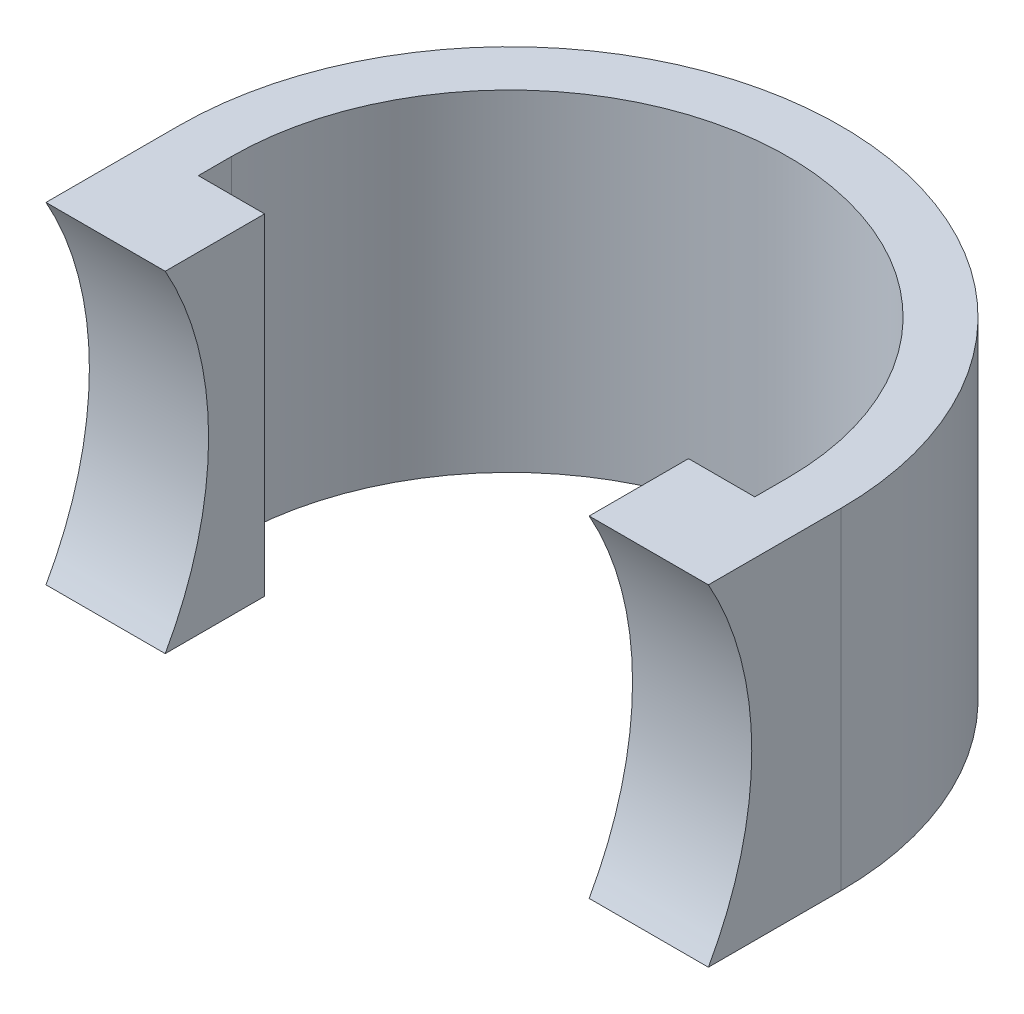
ISO-10303-21;
HEADER;
FILE_DESCRIPTION(('STEP AP214'),'2;1');
FILE_NAME('part.step','',(''),(''),'','','');
FILE_SCHEMA(('AUTOMOTIVE_DESIGN { 1 0 10303 214 1 1 1 1 }'));
ENDSEC;
DATA;
#1=APPLICATION_CONTEXT('core data for automotive mechanical design processes');
#2=APPLICATION_PROTOCOL_DEFINITION('international standard','automotive_design',2000,#1);
#3=PRODUCT_CONTEXT('',#1,'mechanical');
#4=PRODUCT('Part','Part','',(#3));
#5=PRODUCT_RELATED_PRODUCT_CATEGORY('part','',(#4));
#6=PRODUCT_DEFINITION_FORMATION('','',#4);
#7=PRODUCT_DEFINITION_CONTEXT('part definition',#1,'design');
#8=PRODUCT_DEFINITION('design','',#6,#7);
#9=PRODUCT_DEFINITION_SHAPE('','',#8);
#10=(LENGTH_UNIT() NAMED_UNIT(*) SI_UNIT(.MILLI.,.METRE.));
#11=(NAMED_UNIT(*) PLANE_ANGLE_UNIT() SI_UNIT($,.RADIAN.));
#12=(NAMED_UNIT(*) SI_UNIT($,.STERADIAN.) SOLID_ANGLE_UNIT());
#13=UNCERTAINTY_MEASURE_WITH_UNIT(LENGTH_MEASURE(1.E-05),#10,'distance_accuracy_value','');
#14=(GEOMETRIC_REPRESENTATION_CONTEXT(3) GLOBAL_UNCERTAINTY_ASSIGNED_CONTEXT((#13)) GLOBAL_UNIT_ASSIGNED_CONTEXT((#10,
#11,#12)) REPRESENTATION_CONTEXT('',''));
#15=CARTESIAN_POINT('',(0.,0.,0.));
#16=DIRECTION('',(0.,0.,1.));
#17=DIRECTION('',(1.,0.,0.));
#18=AXIS2_PLACEMENT_3D('',#15,#16,#17);
#19=CARTESIAN_POINT('',(-35.0730688935282,14.8225469728601,100.));
#20=DIRECTION('',(1.,0.,0.));
#21=DIRECTION('',(0.,1.,0.));
#22=AXIS2_PLACEMENT_3D('',#19,#20,#21);
#23=PLANE('',#22);
#24=DIRECTION('',(0.,-1.,0.));
#25=VECTOR('',#24,1.);
#26=CARTESIAN_POINT('',(-35.0730688935282,64.8225469728601,80.));
#27=LINE('',#26,#25);
#28=CARTESIAN_POINT('',(-35.0730688935282,14.8225469728601,80.));
#29=VERTEX_POINT('',#28);
#30=CARTESIAN_POINT('',(-35.0730688935282,-35.1774530271399,80.));
#31=VERTEX_POINT('',#30);
#32=EDGE_CURVE('E55',#29,#31,#27,.T.);
#33=ORIENTED_EDGE('',*,*,#32,.T.);
#34=DIRECTION('',(0.,0.,-1.));
#35=VECTOR('',#34,1.);
#36=CARTESIAN_POINT('',(-35.0730688935282,-35.1774530271399,100.));
#37=LINE('',#36,#35);
#38=CARTESIAN_POINT('',(-35.0730688935282,-35.1774530271399,100.));
#39=VERTEX_POINT('',#38);
#40=EDGE_CURVE('E140',#39,#31,#37,.T.);
#41=ORIENTED_EDGE('',*,*,#40,.F.);
#42=CARTESIAN_POINT('',(-35.0730688935282,-10.1774530271399,144.452221541786));
#43=DIRECTION('',(-1.,0.,0.));
#44=DIRECTION('',(0.,-1.,0.));
#45=AXIS2_PLACEMENT_3D('',#42,#43,#44);
#46=CIRCLE('',#45,51.);
#47=CARTESIAN_POINT('',(-35.0730688935282,14.82254697286,100.));
#48=VERTEX_POINT('',#47);
#49=EDGE_CURVE('E209',#48,#39,#46,.T.);
#50=ORIENTED_EDGE('',*,*,#49,.F.);
#51=DIRECTION('',(0.,0.,-1.));
#52=VECTOR('',#51,1.);
#53=CARTESIAN_POINT('',(-35.0730688935282,14.8225469728601,100.));
#54=LINE('',#53,#52);
#55=EDGE_CURVE('E142',#48,#29,#54,.T.);
#56=ORIENTED_EDGE('',*,*,#55,.T.);
#57=EDGE_LOOP('',(#33,#41,#50,#56));
#58=FACE_BOUND('',#57,.T.);
#59=ADVANCED_FACE('F41',(#58),#23,.F.);
#60=CARTESIAN_POINT('',(64.9269311064718,-10.1774530271399,144.452221541786));
#61=DIRECTION('',(-1.,0.,0.));
#62=DIRECTION('',(0.,-1.,0.));
#63=AXIS2_PLACEMENT_3D('',#60,#61,#62);
#64=CYLINDRICAL_SURFACE('',#63,51.);
#65=DIRECTION('',(1.,0.,0.));
#66=VECTOR('',#65,1.);
#67=CARTESIAN_POINT('',(-35.0730688935282,-35.1774530271399,100.));
#68=LINE('',#67,#66);
#69=CARTESIAN_POINT('',(-17.0730688935282,-35.1774530271399,100.));
#70=VERTEX_POINT('',#69);
#71=EDGE_CURVE('E148',#39,#70,#68,.T.);
#72=ORIENTED_EDGE('',*,*,#71,.T.);
#73=CARTESIAN_POINT('',(-17.0730688935282,-10.1774530271399,144.452221541786));
#74=DIRECTION('',(-1.,0.,0.));
#75=DIRECTION('',(0.,0.,1.));
#76=AXIS2_PLACEMENT_3D('',#73,#74,#75);
#77=CIRCLE('',#76,51.);
#78=CARTESIAN_POINT('',(-17.0730688935282,14.82254697286,100.));
#79=VERTEX_POINT('',#78);
#80=EDGE_CURVE('E152',#70,#79,#77,.F.);
#81=ORIENTED_EDGE('',*,*,#80,.T.);
#82=DIRECTION('',(-1.,0.,0.));
#83=VECTOR('',#82,1.);
#84=CARTESIAN_POINT('',(-35.0730688935282,14.8225469728601,100.));
#85=LINE('',#84,#83);
#86=EDGE_CURVE('E216',#79,#48,#85,.T.);
#87=ORIENTED_EDGE('',*,*,#86,.T.);
#88=ORIENTED_EDGE('',*,*,#49,.T.);
#89=EDGE_LOOP('',(#72,#81,#87,#88));
#90=FACE_BOUND('',#89,.T.);
#91=ADVANCED_FACE('F254',(#90),#64,.F.);
#92=CARTESIAN_POINT('',(-35.0730688935282,-35.1774530271399,100.));
#93=DIRECTION('',(0.,1.,0.));
#94=DIRECTION('',(0.,0.,1.));
#95=AXIS2_PLACEMENT_3D('',#92,#93,#94);
#96=PLANE('',#95);
#97=ORIENTED_EDGE('',*,*,#40,.T.);
#98=CARTESIAN_POINT('',(14.9269311064718,-35.1774530271399,80.));
#99=DIRECTION('',(0.,1.,0.));
#100=DIRECTION('',(0.,0.,-1.));
#101=AXIS2_PLACEMENT_3D('',#98,#99,#100);
#102=CIRCLE('',#101,50.);
#103=CARTESIAN_POINT('',(64.9269311064718,-35.1774530271399,80.));
#104=VERTEX_POINT('',#103);
#105=EDGE_CURVE('E126',#104,#31,#102,.T.);
#106=ORIENTED_EDGE('',*,*,#105,.F.);
#107=DIRECTION('',(0.,0.,-1.));
#108=VECTOR('',#107,1.);
#109=CARTESIAN_POINT('',(64.9269311064718,-35.1774530271399,100.));
#110=LINE('',#109,#108);
#111=CARTESIAN_POINT('',(64.9269311064718,-35.1774530271398,100.));
#112=VERTEX_POINT('',#111);
#113=EDGE_CURVE('E150',#112,#104,#110,.T.);
#114=ORIENTED_EDGE('',*,*,#113,.F.);
#115=CARTESIAN_POINT('',(46.9269311064718,-35.1774530271399,100.));
#116=VERTEX_POINT('',#115);
#117=EDGE_CURVE('E213',#116,#112,#68,.T.);
#118=ORIENTED_EDGE('',*,*,#117,.F.);
#119=DIRECTION('',(0.,0.,1.));
#120=VECTOR('',#119,1.);
#121=CARTESIAN_POINT('',(46.9269311064718,-35.1774530271399,100.));
#122=LINE('',#121,#120);
#123=CARTESIAN_POINT('',(46.9269311064718,-35.1774530271399,85.));
#124=VERTEX_POINT('',#123);
#125=EDGE_CURVE('E62',#124,#116,#122,.T.);
#126=ORIENTED_EDGE('',*,*,#125,.F.);
#127=DIRECTION('',(-1.,0.,0.));
#128=VECTOR('',#127,1.);
#129=CARTESIAN_POINT('',(46.9269311064718,-35.1774530271399,85.));
#130=LINE('',#129,#128);
#131=CARTESIAN_POINT('',(56.9269311064718,-35.1774530271399,85.));
#132=VERTEX_POINT('',#131);
#133=EDGE_CURVE('E236',#132,#124,#130,.T.);
#134=ORIENTED_EDGE('',*,*,#133,.F.);
#135=DIRECTION('',(0.,0.,1.));
#136=VECTOR('',#135,1.);
#137=CARTESIAN_POINT('',(56.9269311064718,-35.1774530271399,80.));
#138=LINE('',#137,#136);
#139=CARTESIAN_POINT('',(56.9269311064718,-35.1774530271399,80.));
#140=VERTEX_POINT('',#139);
#141=EDGE_CURVE('E191',#140,#132,#138,.T.);
#142=ORIENTED_EDGE('',*,*,#141,.F.);
#143=CARTESIAN_POINT('',(14.9269311064718,-35.1774530271399,80.));
#144=DIRECTION('',(0.,-1.,0.));
#145=DIRECTION('',(0.,0.,-1.));
#146=AXIS2_PLACEMENT_3D('',#143,#144,#145);
#147=CIRCLE('',#146,42.);
#148=CARTESIAN_POINT('',(-27.0730688935282,-35.1774530271399,80.));
#149=VERTEX_POINT('',#148);
#150=EDGE_CURVE('E232',#149,#140,#147,.T.);
#151=ORIENTED_EDGE('',*,*,#150,.F.);
#152=DIRECTION('',(0.,0.,-1.));
#153=VECTOR('',#152,1.);
#154=CARTESIAN_POINT('',(-27.0730688935282,-35.1774530271399,80.));
#155=LINE('',#154,#153);
#156=CARTESIAN_POINT('',(-27.0730688935282,-35.1774530271399,85.));
#157=VERTEX_POINT('',#156);
#158=EDGE_CURVE('E229',#157,#149,#155,.T.);
#159=ORIENTED_EDGE('',*,*,#158,.F.);
#160=DIRECTION('',(-1.,0.,0.));
#161=VECTOR('',#160,1.);
#162=CARTESIAN_POINT('',(-27.0730688935282,-35.1774530271399,85.));
#163=LINE('',#162,#161);
#164=CARTESIAN_POINT('',(-17.0730688935282,-35.1774530271399,85.));
#165=VERTEX_POINT('',#164);
#166=EDGE_CURVE('E226',#165,#157,#163,.T.);
#167=ORIENTED_EDGE('',*,*,#166,.F.);
#168=DIRECTION('',(0.,0.,-1.));
#169=VECTOR('',#168,1.);
#170=CARTESIAN_POINT('',(-17.0730688935282,-35.1774530271399,85.));
#171=LINE('',#170,#169);
#172=EDGE_CURVE('E134',#70,#165,#171,.T.);
#173=ORIENTED_EDGE('',*,*,#172,.F.);
#174=ORIENTED_EDGE('',*,*,#71,.F.);
#175=EDGE_LOOP('',(#97,#106,#114,#118,#126,#134,#142,#151,#159,#167,#173,#174));
#176=FACE_BOUND('',#175,.T.);
#177=ADVANCED_FACE('F145',(#176),#96,.F.);
#178=CARTESIAN_POINT('',(64.9269311064718,14.8225469728601,100.));
#179=DIRECTION('',(-1.,0.,0.));
#180=DIRECTION('',(0.,-1.,0.));
#181=AXIS2_PLACEMENT_3D('',#178,#179,#180);
#182=PLANE('',#181);
#183=ORIENTED_EDGE('',*,*,#113,.T.);
#184=DIRECTION('',(0.,-1.,0.));
#185=VECTOR('',#184,1.);
#186=CARTESIAN_POINT('',(64.9269311064718,64.8225469728601,80.));
#187=LINE('',#186,#185);
#188=CARTESIAN_POINT('',(64.9269311064718,14.8225469728601,80.));
#189=VERTEX_POINT('',#188);
#190=EDGE_CURVE('E129',#189,#104,#187,.T.);
#191=ORIENTED_EDGE('',*,*,#190,.F.);
#192=DIRECTION('',(0.,0.,-1.));
#193=VECTOR('',#192,1.);
#194=CARTESIAN_POINT('',(64.9269311064718,14.8225469728601,100.));
#195=LINE('',#194,#193);
#196=CARTESIAN_POINT('',(64.9269311064718,14.82254697286,100.));
#197=VERTEX_POINT('',#196);
#198=EDGE_CURVE('E154',#197,#189,#195,.T.);
#199=ORIENTED_EDGE('',*,*,#198,.F.);
#200=CARTESIAN_POINT('',(64.9269311064718,-10.1774530271399,144.452221541786));
#201=DIRECTION('',(-1.,0.,0.));
#202=DIRECTION('',(0.,-1.,0.));
#203=AXIS2_PLACEMENT_3D('',#200,#201,#202);
#204=CIRCLE('',#203,51.);
#205=EDGE_CURVE('E210',#197,#112,#204,.T.);
#206=ORIENTED_EDGE('',*,*,#205,.T.);
#207=EDGE_LOOP('',(#183,#191,#199,#206));
#208=FACE_BOUND('',#207,.T.);
#209=ADVANCED_FACE('F221',(#208),#182,.F.);
#210=CARTESIAN_POINT('',(-35.0730688935282,14.8225469728601,100.));
#211=DIRECTION('',(0.,-1.,0.));
#212=DIRECTION('',(0.,0.,-1.));
#213=AXIS2_PLACEMENT_3D('',#210,#211,#212);
#214=PLANE('',#213);
#215=ORIENTED_EDGE('',*,*,#198,.T.);
#216=CARTESIAN_POINT('',(14.9269311064718,14.8225469728601,80.));
#217=DIRECTION('',(0.,-1.,0.));
#218=DIRECTION('',(0.,0.,-1.));
#219=AXIS2_PLACEMENT_3D('',#216,#217,#218);
#220=CIRCLE('',#219,50.);
#221=EDGE_CURVE('E11',#189,#29,#220,.F.);
#222=ORIENTED_EDGE('',*,*,#221,.T.);
#223=ORIENTED_EDGE('',*,*,#55,.F.);
#224=ORIENTED_EDGE('',*,*,#86,.F.);
#225=DIRECTION('',(0.,0.,-1.));
#226=VECTOR('',#225,1.);
#227=CARTESIAN_POINT('',(-17.0730688935282,14.8225469728601,100.));
#228=LINE('',#227,#226);
#229=CARTESIAN_POINT('',(-17.0730688935282,14.8225469728601,85.));
#230=VERTEX_POINT('',#229);
#231=EDGE_CURVE('E206',#79,#230,#228,.T.);
#232=ORIENTED_EDGE('',*,*,#231,.T.);
#233=DIRECTION('',(-1.,0.,0.));
#234=VECTOR('',#233,1.);
#235=CARTESIAN_POINT('',(-35.0730688935282,14.8225469728601,85.));
#236=LINE('',#235,#234);
#237=CARTESIAN_POINT('',(-27.0730688935282,14.8225469728601,85.));
#238=VERTEX_POINT('',#237);
#239=EDGE_CURVE('E160',#230,#238,#236,.T.);
#240=ORIENTED_EDGE('',*,*,#239,.T.);
#241=DIRECTION('',(0.,0.,-1.));
#242=VECTOR('',#241,1.);
#243=CARTESIAN_POINT('',(-27.0730688935282,14.8225469728601,100.));
#244=LINE('',#243,#242);
#245=CARTESIAN_POINT('',(-27.0730688935282,14.8225469728601,80.));
#246=VERTEX_POINT('',#245);
#247=EDGE_CURVE('E163',#238,#246,#244,.T.);
#248=ORIENTED_EDGE('',*,*,#247,.T.);
#249=CARTESIAN_POINT('',(14.9269311064718,14.8225469728601,80.));
#250=DIRECTION('',(0.,-1.,0.));
#251=DIRECTION('',(0.,0.,-1.));
#252=AXIS2_PLACEMENT_3D('',#249,#250,#251);
#253=CIRCLE('',#252,42.);
#254=CARTESIAN_POINT('',(56.9269311064718,14.8225469728601,80.));
#255=VERTEX_POINT('',#254);
#256=EDGE_CURVE('E166',#246,#255,#253,.T.);
#257=ORIENTED_EDGE('',*,*,#256,.T.);
#258=DIRECTION('',(0.,0.,1.));
#259=VECTOR('',#258,1.);
#260=CARTESIAN_POINT('',(56.9269311064718,14.8225469728601,100.));
#261=LINE('',#260,#259);
#262=CARTESIAN_POINT('',(56.9269311064718,14.8225469728601,85.));
#263=VERTEX_POINT('',#262);
#264=EDGE_CURVE('E169',#255,#263,#261,.T.);
#265=ORIENTED_EDGE('',*,*,#264,.T.);
#266=DIRECTION('',(-1.,0.,0.));
#267=VECTOR('',#266,1.);
#268=CARTESIAN_POINT('',(-35.0730688935282,14.8225469728601,85.0000000000001));
#269=LINE('',#268,#267);
#270=CARTESIAN_POINT('',(46.9269311064718,14.8225469728601,85.));
#271=VERTEX_POINT('',#270);
#272=EDGE_CURVE('E48',#263,#271,#269,.T.);
#273=ORIENTED_EDGE('',*,*,#272,.T.);
#274=DIRECTION('',(0.,0.,1.));
#275=VECTOR('',#274,1.);
#276=CARTESIAN_POINT('',(46.9269311064718,14.8225469728601,100.));
#277=LINE('',#276,#275);
#278=CARTESIAN_POINT('',(46.9269311064718,14.82254697286,100.));
#279=VERTEX_POINT('',#278);
#280=EDGE_CURVE('E177',#271,#279,#277,.T.);
#281=ORIENTED_EDGE('',*,*,#280,.T.);
#282=EDGE_CURVE('E217',#197,#279,#85,.T.);
#283=ORIENTED_EDGE('',*,*,#282,.F.);
#284=EDGE_LOOP('',(#215,#222,#223,#224,#232,#240,#248,#257,#265,#273,#281,#283));
#285=FACE_BOUND('',#284,.T.);
#286=ADVANCED_FACE('F175',(#285),#214,.F.);
#287=ORIENTED_EDGE('',*,*,#282,.T.);
#288=CARTESIAN_POINT('',(46.9269311064718,-10.1774530271399,144.452221541786));
#289=DIRECTION('',(1.,0.,0.));
#290=DIRECTION('',(0.,0.,-1.));
#291=AXIS2_PLACEMENT_3D('',#288,#289,#290);
#292=CIRCLE('',#291,51.);
#293=EDGE_CURVE('E149',#279,#116,#292,.F.);
#294=ORIENTED_EDGE('',*,*,#293,.T.);
#295=ORIENTED_EDGE('',*,*,#117,.T.);
#296=ORIENTED_EDGE('',*,*,#205,.F.);
#297=EDGE_LOOP('',(#287,#294,#295,#296));
#298=FACE_BOUND('',#297,.T.);
#299=ADVANCED_FACE('F239',(#298),#64,.F.);
#300=CARTESIAN_POINT('',(46.9269311064718,64.8225469728601,85.));
#301=DIRECTION('',(0.,0.,1.));
#302=DIRECTION('',(1.,0.,0.));
#303=AXIS2_PLACEMENT_3D('',#300,#301,#302);
#304=PLANE('',#303);
#305=DIRECTION('',(0.,-1.,0.));
#306=VECTOR('',#305,1.);
#307=CARTESIAN_POINT('',(56.9269311064718,64.8225469728601,85.));
#308=LINE('',#307,#306);
#309=EDGE_CURVE('E184',#263,#132,#308,.T.);
#310=ORIENTED_EDGE('',*,*,#309,.T.);
#311=ORIENTED_EDGE('',*,*,#133,.T.);
#312=DIRECTION('',(0.,-1.,0.));
#313=VECTOR('',#312,1.);
#314=CARTESIAN_POINT('',(46.9269311064718,64.8225469728601,85.));
#315=LINE('',#314,#313);
#316=EDGE_CURVE('E186',#271,#124,#315,.T.);
#317=ORIENTED_EDGE('',*,*,#316,.F.);
#318=ORIENTED_EDGE('',*,*,#272,.F.);
#319=EDGE_LOOP('',(#310,#311,#317,#318));
#320=FACE_BOUND('',#319,.T.);
#321=ADVANCED_FACE('F182',(#320),#304,.F.);
#322=CARTESIAN_POINT('',(56.9269311064718,64.8225469728601,80.));
#323=DIRECTION('',(1.,0.,0.));
#324=DIRECTION('',(0.,0.,-1.));
#325=AXIS2_PLACEMENT_3D('',#322,#323,#324);
#326=PLANE('',#325);
#327=DIRECTION('',(0.,-1.,0.));
#328=VECTOR('',#327,1.);
#329=CARTESIAN_POINT('',(56.9269311064718,64.8225469728601,80.));
#330=LINE('',#329,#328);
#331=EDGE_CURVE('E193',#255,#140,#330,.T.);
#332=ORIENTED_EDGE('',*,*,#331,.T.);
#333=ORIENTED_EDGE('',*,*,#141,.T.);
#334=ORIENTED_EDGE('',*,*,#309,.F.);
#335=ORIENTED_EDGE('',*,*,#264,.F.);
#336=EDGE_LOOP('',(#332,#333,#334,#335));
#337=FACE_BOUND('',#336,.T.);
#338=ADVANCED_FACE('F188',(#337),#326,.F.);
#339=CARTESIAN_POINT('',(14.9269311064718,64.8225469728601,80.));
#340=DIRECTION('',(0.,-1.,0.));
#341=DIRECTION('',(0.,0.,-1.));
#342=AXIS2_PLACEMENT_3D('',#339,#340,#341);
#343=CYLINDRICAL_SURFACE('',#342,42.);
#344=DIRECTION('',(0.,-1.,0.));
#345=VECTOR('',#344,1.);
#346=CARTESIAN_POINT('',(-27.0730688935282,64.8225469728601,80.));
#347=LINE('',#346,#345);
#348=EDGE_CURVE('E196',#246,#149,#347,.T.);
#349=ORIENTED_EDGE('',*,*,#348,.T.);
#350=ORIENTED_EDGE('',*,*,#150,.T.);
#351=ORIENTED_EDGE('',*,*,#331,.F.);
#352=ORIENTED_EDGE('',*,*,#256,.F.);
#353=EDGE_LOOP('',(#349,#350,#351,#352));
#354=FACE_BOUND('',#353,.T.);
#355=ADVANCED_FACE('F306',(#354),#343,.F.);
#356=CARTESIAN_POINT('',(-27.0730688935282,64.8225469728601,80.));
#357=DIRECTION('',(-1.,0.,0.));
#358=DIRECTION('',(0.,0.,1.));
#359=AXIS2_PLACEMENT_3D('',#356,#357,#358);
#360=PLANE('',#359);
#361=DIRECTION('',(0.,-1.,0.));
#362=VECTOR('',#361,1.);
#363=CARTESIAN_POINT('',(-27.0730688935282,64.8225469728601,85.));
#364=LINE('',#363,#362);
#365=EDGE_CURVE('E201',#238,#157,#364,.T.);
#366=ORIENTED_EDGE('',*,*,#365,.T.);
#367=ORIENTED_EDGE('',*,*,#158,.T.);
#368=ORIENTED_EDGE('',*,*,#348,.F.);
#369=ORIENTED_EDGE('',*,*,#247,.F.);
#370=EDGE_LOOP('',(#366,#367,#368,#369));
#371=FACE_BOUND('',#370,.T.);
#372=ADVANCED_FACE('F315',(#371),#360,.F.);
#373=CARTESIAN_POINT('',(-27.0730688935282,64.8225469728601,85.));
#374=DIRECTION('',(0.,0.,1.));
#375=DIRECTION('',(1.,0.,0.));
#376=AXIS2_PLACEMENT_3D('',#373,#374,#375);
#377=PLANE('',#376);
#378=DIRECTION('',(0.,-1.,0.));
#379=VECTOR('',#378,1.);
#380=CARTESIAN_POINT('',(-17.0730688935282,64.8225469728601,85.));
#381=LINE('',#380,#379);
#382=EDGE_CURVE('E203',#230,#165,#381,.T.);
#383=ORIENTED_EDGE('',*,*,#382,.T.);
#384=ORIENTED_EDGE('',*,*,#166,.T.);
#385=ORIENTED_EDGE('',*,*,#365,.F.);
#386=ORIENTED_EDGE('',*,*,#239,.F.);
#387=EDGE_LOOP('',(#383,#384,#385,#386));
#388=FACE_BOUND('',#387,.T.);
#389=ADVANCED_FACE('F249',(#388),#377,.F.);
#390=CARTESIAN_POINT('',(-17.0730688935282,64.8225469728601,85.));
#391=DIRECTION('',(-1.,0.,0.));
#392=DIRECTION('',(0.,0.,1.));
#393=AXIS2_PLACEMENT_3D('',#390,#391,#392);
#394=PLANE('',#393);
#395=ORIENTED_EDGE('',*,*,#80,.F.);
#396=ORIENTED_EDGE('',*,*,#172,.T.);
#397=ORIENTED_EDGE('',*,*,#382,.F.);
#398=ORIENTED_EDGE('',*,*,#231,.F.);
#399=EDGE_LOOP('',(#395,#396,#397,#398));
#400=FACE_BOUND('',#399,.T.);
#401=ADVANCED_FACE('F242',(#400),#394,.F.);
#402=CARTESIAN_POINT('',(46.9269311064718,64.8225469728601,100.));
#403=DIRECTION('',(1.,0.,0.));
#404=DIRECTION('',(0.,0.,-1.));
#405=AXIS2_PLACEMENT_3D('',#402,#403,#404);
#406=PLANE('',#405);
#407=ORIENTED_EDGE('',*,*,#316,.T.);
#408=ORIENTED_EDGE('',*,*,#125,.T.);
#409=ORIENTED_EDGE('',*,*,#293,.F.);
#410=ORIENTED_EDGE('',*,*,#280,.F.);
#411=EDGE_LOOP('',(#407,#408,#409,#410));
#412=FACE_BOUND('',#411,.T.);
#413=ADVANCED_FACE('F240',(#412),#406,.F.);
#414=CARTESIAN_POINT('',(14.9269311064718,64.8225469728601,80.));
#415=DIRECTION('',(0.,-1.,0.));
#416=DIRECTION('',(0.,0.,-1.));
#417=AXIS2_PLACEMENT_3D('',#414,#415,#416);
#418=CYLINDRICAL_SURFACE('',#417,50.);
#419=ORIENTED_EDGE('',*,*,#190,.T.);
#420=ORIENTED_EDGE('',*,*,#105,.T.);
#421=ORIENTED_EDGE('',*,*,#32,.F.);
#422=ORIENTED_EDGE('',*,*,#221,.F.);
#423=EDGE_LOOP('',(#419,#420,#421,#422));
#424=FACE_BOUND('',#423,.T.);
#425=ADVANCED_FACE('F127',(#424),#418,.T.);
#426=CLOSED_SHELL('',(#59,#91,#177,#209,#286,#299,#321,#338,#355,#372,#389,#401,#413,#425));
#427=MANIFOLD_SOLID_BREP('B2',#426);
#428=ADVANCED_BREP_SHAPE_REPRESENTATION('',(#18,#427),#14);
#429=SHAPE_DEFINITION_REPRESENTATION(#9,#428);
ENDSEC;
END-ISO-10303-21;
